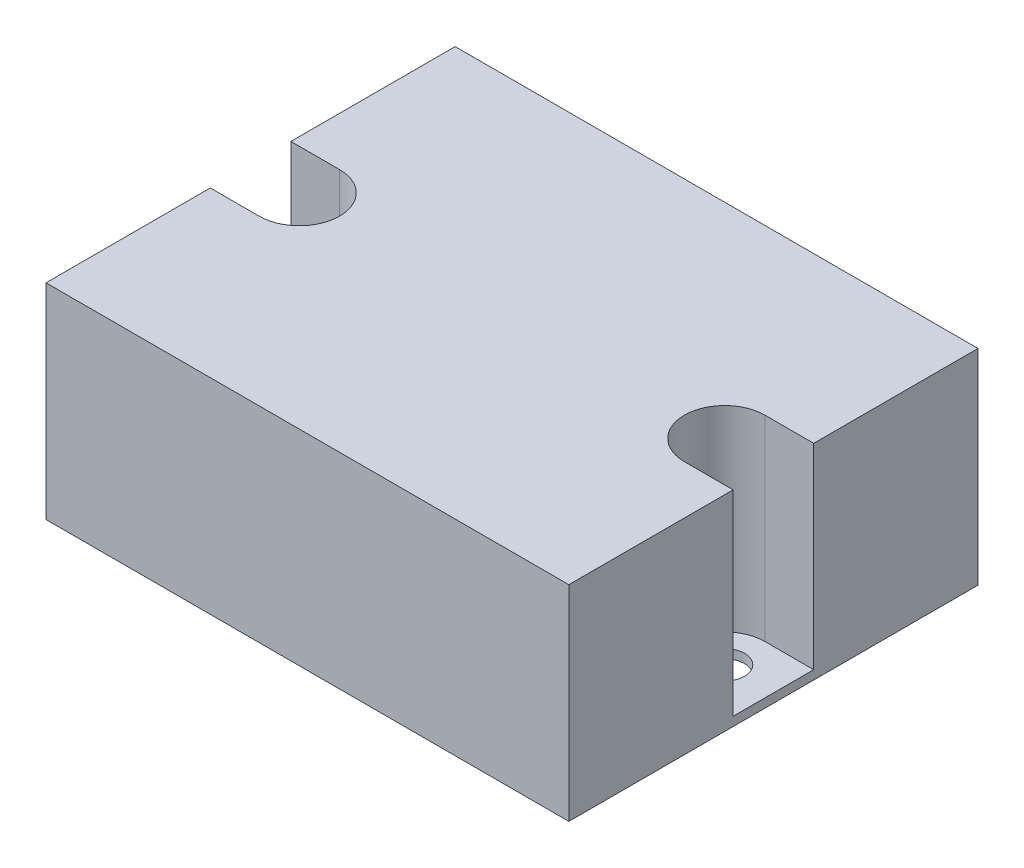
ISO-10303-21;
HEADER;
FILE_DESCRIPTION(('STEP AP214'),'2;1');
FILE_NAME('part.step','',(''),(''),'','','');
FILE_SCHEMA(('AUTOMOTIVE_DESIGN { 1 0 10303 214 1 1 1 1 }'));
ENDSEC;
DATA;
#1=APPLICATION_CONTEXT('core data for automotive mechanical design processes');
#2=APPLICATION_PROTOCOL_DEFINITION('international standard','automotive_design',2000,#1);
#3=PRODUCT_CONTEXT('',#1,'mechanical');
#4=PRODUCT('Part','Part','',(#3));
#5=PRODUCT_RELATED_PRODUCT_CATEGORY('part','',(#4));
#6=PRODUCT_DEFINITION_FORMATION('','',#4);
#7=PRODUCT_DEFINITION_CONTEXT('part definition',#1,'design');
#8=PRODUCT_DEFINITION('design','',#6,#7);
#9=PRODUCT_DEFINITION_SHAPE('','',#8);
#10=(LENGTH_UNIT() NAMED_UNIT(*) SI_UNIT(.MILLI.,.METRE.));
#11=(NAMED_UNIT(*) PLANE_ANGLE_UNIT() SI_UNIT($,.RADIAN.));
#12=(NAMED_UNIT(*) SI_UNIT($,.STERADIAN.) SOLID_ANGLE_UNIT());
#13=UNCERTAINTY_MEASURE_WITH_UNIT(LENGTH_MEASURE(1.E-05),#10,'distance_accuracy_value','');
#14=(GEOMETRIC_REPRESENTATION_CONTEXT(3) GLOBAL_UNCERTAINTY_ASSIGNED_CONTEXT((#13)) GLOBAL_UNIT_ASSIGNED_CONTEXT((#10,
#11,#12)) REPRESENTATION_CONTEXT('',''));
#15=CARTESIAN_POINT('',(0.,0.,0.));
#16=DIRECTION('',(0.,0.,1.));
#17=DIRECTION('',(1.,0.,0.));
#18=AXIS2_PLACEMENT_3D('',#15,#16,#17);
#19=CARTESIAN_POINT('',(5.45,1.,-22.85));
#20=DIRECTION('',(0.,1.,0.));
#21=DIRECTION('',(0.,0.,1.));
#22=AXIS2_PLACEMENT_3D('',#19,#20,#21);
#23=PLANE('',#22);
#24=DIRECTION('',(1.,0.,0.));
#25=VECTOR('',#24,1.);
#26=CARTESIAN_POINT('',(52.95,1.,-27.35));
#27=LINE('',#26,#25);
#28=CARTESIAN_POINT('',(52.95,1.,-27.35));
#29=VERTEX_POINT('',#28);
#30=CARTESIAN_POINT('',(58.4,1.,-27.35));
#31=VERTEX_POINT('',#30);
#32=EDGE_CURVE('E50',#29,#31,#27,.T.);
#33=ORIENTED_EDGE('',*,*,#32,.F.);
#34=CARTESIAN_POINT('',(52.95,1.,-22.85));
#35=DIRECTION('',(0.,-1.,0.));
#36=DIRECTION('',(0.,0.,1.));
#37=AXIS2_PLACEMENT_3D('',#34,#35,#36);
#38=CIRCLE('',#37,4.5);
#39=CARTESIAN_POINT('',(52.95,1.,-18.35));
#40=VERTEX_POINT('',#39);
#41=EDGE_CURVE('E54',#40,#29,#38,.T.);
#42=ORIENTED_EDGE('',*,*,#41,.F.);
#43=DIRECTION('',(-1.,0.,0.));
#44=VECTOR('',#43,1.);
#45=CARTESIAN_POINT('',(52.95,1.,-18.35));
#46=LINE('',#45,#44);
#47=CARTESIAN_POINT('',(58.4,1.,-18.35));
#48=VERTEX_POINT('',#47);
#49=EDGE_CURVE('E300',#48,#40,#46,.T.);
#50=ORIENTED_EDGE('',*,*,#49,.F.);
#51=DIRECTION('',(0.,0.,-1.));
#52=VECTOR('',#51,1.);
#53=CARTESIAN_POINT('',(58.4,1.,0.));
#54=LINE('',#53,#52);
#55=EDGE_CURVE('E213',#48,#31,#54,.T.);
#56=ORIENTED_EDGE('',*,*,#55,.T.);
#57=EDGE_LOOP('',(#33,#42,#50,#56));
#58=FACE_BOUND('',#57,.T.);
#59=CARTESIAN_POINT('',(52.95,1.,-22.85));
#60=DIRECTION('',(0.,1.,0.));
#61=DIRECTION('',(0.,0.,1.));
#62=AXIS2_PLACEMENT_3D('',#59,#60,#61);
#63=CIRCLE('',#62,2.225);
#64=CARTESIAN_POINT('',(52.95,1.,-20.625));
#65=VERTEX_POINT('',#64);
#66=EDGE_CURVE('E175',#65,#65,#63,.T.);
#67=ORIENTED_EDGE('',*,*,#66,.F.);
#68=EDGE_LOOP('',(#67));
#69=FACE_BOUND('',#68,.T.);
#70=ADVANCED_FACE('F33',(#58,#69),#23,.T.);
#71=DIRECTION('',(-1.,0.,0.));
#72=VECTOR('',#71,1.);
#73=CARTESIAN_POINT('',(5.45,1.,-18.35));
#74=LINE('',#73,#72);
#75=CARTESIAN_POINT('',(5.45,1.,-18.35));
#76=VERTEX_POINT('',#75);
#77=CARTESIAN_POINT('',(0.,1.,-18.35));
#78=VERTEX_POINT('',#77);
#79=EDGE_CURVE('E296',#76,#78,#74,.T.);
#80=ORIENTED_EDGE('',*,*,#79,.F.);
#81=CARTESIAN_POINT('',(5.45,1.,-22.85));
#82=DIRECTION('',(0.,-1.,0.));
#83=DIRECTION('',(0.,0.,1.));
#84=AXIS2_PLACEMENT_3D('',#81,#82,#83);
#85=CIRCLE('',#84,4.5);
#86=CARTESIAN_POINT('',(5.45,1.,-27.35));
#87=VERTEX_POINT('',#86);
#88=EDGE_CURVE('E295',#87,#76,#85,.T.);
#89=ORIENTED_EDGE('',*,*,#88,.F.);
#90=DIRECTION('',(1.,0.,0.));
#91=VECTOR('',#90,1.);
#92=CARTESIAN_POINT('',(5.45,1.,-27.35));
#93=LINE('',#92,#91);
#94=CARTESIAN_POINT('',(0.,1.,-27.35));
#95=VERTEX_POINT('',#94);
#96=EDGE_CURVE('E218',#95,#87,#93,.T.);
#97=ORIENTED_EDGE('',*,*,#96,.F.);
#98=DIRECTION('',(0.,0.,1.));
#99=VECTOR('',#98,1.);
#100=CARTESIAN_POINT('',(0.,1.,-25.1));
#101=LINE('',#100,#99);
#102=CARTESIAN_POINT('',(0.,1.,-25.1));
#103=VERTEX_POINT('',#102);
#104=EDGE_CURVE('E171',#95,#103,#101,.T.);
#105=ORIENTED_EDGE('',*,*,#104,.T.);
#106=DIRECTION('',(1.,0.,0.));
#107=VECTOR('',#106,1.);
#108=CARTESIAN_POINT('',(5.45,1.,-25.1));
#109=LINE('',#108,#107);
#110=CARTESIAN_POINT('',(5.45,1.,-25.1));
#111=VERTEX_POINT('',#110);
#112=EDGE_CURVE('E217',#103,#111,#109,.T.);
#113=ORIENTED_EDGE('',*,*,#112,.T.);
#114=CARTESIAN_POINT('',(5.45,1.,-22.85));
#115=DIRECTION('',(0.,-1.,0.));
#116=DIRECTION('',(0.,0.,1.));
#117=AXIS2_PLACEMENT_3D('',#114,#115,#116);
#118=CIRCLE('',#117,2.25);
#119=CARTESIAN_POINT('',(5.45,1.,-20.6));
#120=VERTEX_POINT('',#119);
#121=EDGE_CURVE('E222',#111,#120,#118,.T.);
#122=ORIENTED_EDGE('',*,*,#121,.T.);
#123=DIRECTION('',(-1.,0.,0.));
#124=VECTOR('',#123,1.);
#125=CARTESIAN_POINT('',(5.45,1.,-20.6));
#126=LINE('',#125,#124);
#127=CARTESIAN_POINT('',(0.,1.,-20.6));
#128=VERTEX_POINT('',#127);
#129=EDGE_CURVE('E224',#120,#128,#126,.T.);
#130=ORIENTED_EDGE('',*,*,#129,.T.);
#131=DIRECTION('',(0.,0.,1.));
#132=VECTOR('',#131,1.);
#133=CARTESIAN_POINT('',(0.,1.,0.));
#134=LINE('',#133,#132);
#135=EDGE_CURVE('E211',#128,#78,#134,.T.);
#136=ORIENTED_EDGE('',*,*,#135,.T.);
#137=EDGE_LOOP('',(#80,#89,#97,#105,#113,#122,#130,#136));
#138=FACE_BOUND('',#137,.T.);
#139=ADVANCED_FACE('F292',(#138),#23,.T.);
#140=CARTESIAN_POINT('',(5.45,0.,-22.85));
#141=DIRECTION('',(0.,1.,0.));
#142=DIRECTION('',(0.,0.,1.));
#143=AXIS2_PLACEMENT_3D('',#140,#141,#142);
#144=PLANE('',#143);
#145=DIRECTION('',(0.,0.,1.));
#146=VECTOR('',#145,1.);
#147=CARTESIAN_POINT('',(0.,0.,0.));
#148=LINE('',#147,#146);
#149=CARTESIAN_POINT('',(0.,0.,-20.6));
#150=VERTEX_POINT('',#149);
#151=CARTESIAN_POINT('',(0.,0.,0.));
#152=VERTEX_POINT('',#151);
#153=EDGE_CURVE('E204',#150,#152,#148,.T.);
#154=ORIENTED_EDGE('',*,*,#153,.F.);
#155=DIRECTION('',(-1.,0.,0.));
#156=VECTOR('',#155,1.);
#157=CARTESIAN_POINT('',(5.45,0.,-20.6));
#158=LINE('',#157,#156);
#159=CARTESIAN_POINT('',(5.45,0.,-20.6));
#160=VERTEX_POINT('',#159);
#161=EDGE_CURVE('E214',#160,#150,#158,.T.);
#162=ORIENTED_EDGE('',*,*,#161,.F.);
#163=CARTESIAN_POINT('',(5.45,0.,-22.85));
#164=DIRECTION('',(0.,-1.,0.));
#165=DIRECTION('',(0.,0.,1.));
#166=AXIS2_PLACEMENT_3D('',#163,#164,#165);
#167=CIRCLE('',#166,2.25);
#168=CARTESIAN_POINT('',(5.45,0.,-25.1));
#169=VERTEX_POINT('',#168);
#170=EDGE_CURVE('E239',#169,#160,#167,.T.);
#171=ORIENTED_EDGE('',*,*,#170,.F.);
#172=DIRECTION('',(1.,0.,0.));
#173=VECTOR('',#172,1.);
#174=CARTESIAN_POINT('',(5.45,0.,-25.1));
#175=LINE('',#174,#173);
#176=CARTESIAN_POINT('',(0.,0.,-25.1));
#177=VERTEX_POINT('',#176);
#178=EDGE_CURVE('E237',#177,#169,#175,.T.);
#179=ORIENTED_EDGE('',*,*,#178,.F.);
#180=DIRECTION('',(0.,0.,1.));
#181=VECTOR('',#180,1.);
#182=CARTESIAN_POINT('',(0.,0.,-25.1));
#183=LINE('',#182,#181);
#184=CARTESIAN_POINT('',(0.,0.,-45.7));
#185=VERTEX_POINT('',#184);
#186=EDGE_CURVE('E235',#185,#177,#183,.T.);
#187=ORIENTED_EDGE('',*,*,#186,.F.);
#188=DIRECTION('',(-1.,0.,0.));
#189=VECTOR('',#188,1.);
#190=CARTESIAN_POINT('',(0.,0.,-45.7));
#191=LINE('',#190,#189);
#192=CARTESIAN_POINT('',(58.4,0.,-45.7));
#193=VERTEX_POINT('',#192);
#194=EDGE_CURVE('E233',#193,#185,#191,.T.);
#195=ORIENTED_EDGE('',*,*,#194,.F.);
#196=DIRECTION('',(0.,0.,-1.));
#197=VECTOR('',#196,1.);
#198=CARTESIAN_POINT('',(58.4,0.,0.));
#199=LINE('',#198,#197);
#200=CARTESIAN_POINT('',(58.4,0.,0.));
#201=VERTEX_POINT('',#200);
#202=EDGE_CURVE('E231',#201,#193,#199,.T.);
#203=ORIENTED_EDGE('',*,*,#202,.F.);
#204=DIRECTION('',(1.,0.,0.));
#205=VECTOR('',#204,1.);
#206=CARTESIAN_POINT('',(0.,0.,0.));
#207=LINE('',#206,#205);
#208=EDGE_CURVE('E229',#152,#201,#207,.T.);
#209=ORIENTED_EDGE('',*,*,#208,.F.);
#210=EDGE_LOOP('',(#154,#162,#171,#179,#187,#195,#203,#209));
#211=FACE_BOUND('',#210,.T.);
#212=CARTESIAN_POINT('',(52.95,0.,-22.85));
#213=DIRECTION('',(0.,1.,0.));
#214=DIRECTION('',(0.,0.,1.));
#215=AXIS2_PLACEMENT_3D('',#212,#213,#214);
#216=CIRCLE('',#215,2.225);
#217=CARTESIAN_POINT('',(52.95,0.,-20.625));
#218=VERTEX_POINT('',#217);
#219=EDGE_CURVE('E172',#218,#218,#216,.T.);
#220=ORIENTED_EDGE('',*,*,#219,.T.);
#221=EDGE_LOOP('',(#220));
#222=FACE_BOUND('',#221,.T.);
#223=ADVANCED_FACE('F270',(#211,#222),#144,.F.);
#224=CARTESIAN_POINT('',(0.,1.,0.));
#225=DIRECTION('',(1.,0.,0.));
#226=DIRECTION('',(0.,0.,-1.));
#227=AXIS2_PLACEMENT_3D('',#224,#225,#226);
#228=PLANE('',#227);
#229=ORIENTED_EDGE('',*,*,#153,.T.);
#230=DIRECTION('',(0.,-1.,0.));
#231=VECTOR('',#230,1.);
#232=CARTESIAN_POINT('',(0.,1.,0.));
#233=LINE('',#232,#231);
#234=CARTESIAN_POINT('',(0.,22.9,0.));
#235=VERTEX_POINT('',#234);
#236=EDGE_CURVE('E11',#235,#152,#233,.T.);
#237=ORIENTED_EDGE('',*,*,#236,.F.);
#238=DIRECTION('',(0.,0.,1.));
#239=VECTOR('',#238,1.);
#240=CARTESIAN_POINT('',(0.,22.9,-18.35));
#241=LINE('',#240,#239);
#242=CARTESIAN_POINT('',(0.,22.9,-18.35));
#243=VERTEX_POINT('',#242);
#244=EDGE_CURVE('E341',#243,#235,#241,.T.);
#245=ORIENTED_EDGE('',*,*,#244,.F.);
#246=DIRECTION('',(0.,-1.,0.));
#247=VECTOR('',#246,1.);
#248=CARTESIAN_POINT('',(0.,22.9,-18.35));
#249=LINE('',#248,#247);
#250=EDGE_CURVE('E201',#243,#78,#249,.T.);
#251=ORIENTED_EDGE('',*,*,#250,.T.);
#252=ORIENTED_EDGE('',*,*,#135,.F.);
#253=DIRECTION('',(0.,-1.,0.));
#254=VECTOR('',#253,1.);
#255=CARTESIAN_POINT('',(0.,1.,-20.6));
#256=LINE('',#255,#254);
#257=EDGE_CURVE('E226',#128,#150,#256,.T.);
#258=ORIENTED_EDGE('',*,*,#257,.T.);
#259=EDGE_LOOP('',(#229,#237,#245,#251,#252,#258));
#260=FACE_BOUND('',#259,.T.);
#261=ADVANCED_FACE('F35',(#260),#228,.F.);
#262=CARTESIAN_POINT('',(0.,1.,0.));
#263=DIRECTION('',(0.,0.,-1.));
#264=DIRECTION('',(-1.,0.,0.));
#265=AXIS2_PLACEMENT_3D('',#262,#263,#264);
#266=PLANE('',#265);
#267=ORIENTED_EDGE('',*,*,#208,.T.);
#268=DIRECTION('',(0.,-1.,0.));
#269=VECTOR('',#268,1.);
#270=CARTESIAN_POINT('',(58.4,1.,0.));
#271=LINE('',#270,#269);
#272=CARTESIAN_POINT('',(58.4,22.9,0.));
#273=VERTEX_POINT('',#272);
#274=EDGE_CURVE('E42',#273,#201,#271,.T.);
#275=ORIENTED_EDGE('',*,*,#274,.F.);
#276=DIRECTION('',(1.,0.,0.));
#277=VECTOR('',#276,1.);
#278=CARTESIAN_POINT('',(0.,22.9,0.));
#279=LINE('',#278,#277);
#280=EDGE_CURVE('E339',#235,#273,#279,.T.);
#281=ORIENTED_EDGE('',*,*,#280,.F.);
#282=ORIENTED_EDGE('',*,*,#236,.T.);
#283=EDGE_LOOP('',(#267,#275,#281,#282));
#284=FACE_BOUND('',#283,.T.);
#285=ADVANCED_FACE('F350',(#284),#266,.F.);
#286=CARTESIAN_POINT('',(58.4,1.,0.));
#287=DIRECTION('',(-1.,0.,0.));
#288=DIRECTION('',(0.,0.,1.));
#289=AXIS2_PLACEMENT_3D('',#286,#287,#288);
#290=PLANE('',#289);
#291=ORIENTED_EDGE('',*,*,#202,.T.);
#292=DIRECTION('',(0.,-1.,0.));
#293=VECTOR('',#292,1.);
#294=CARTESIAN_POINT('',(58.4,1.,-45.7));
#295=LINE('',#294,#293);
#296=CARTESIAN_POINT('',(58.4,22.9,-45.7));
#297=VERTEX_POINT('',#296);
#298=EDGE_CURVE('E255',#297,#193,#295,.T.);
#299=ORIENTED_EDGE('',*,*,#298,.F.);
#300=DIRECTION('',(0.,0.,-1.));
#301=VECTOR('',#300,1.);
#302=CARTESIAN_POINT('',(58.4,22.9,-45.7));
#303=LINE('',#302,#301);
#304=CARTESIAN_POINT('',(58.4,22.9,-27.35));
#305=VERTEX_POINT('',#304);
#306=EDGE_CURVE('E331',#305,#297,#303,.T.);
#307=ORIENTED_EDGE('',*,*,#306,.F.);
#308=DIRECTION('',(0.,-1.,0.));
#309=VECTOR('',#308,1.);
#310=CARTESIAN_POINT('',(58.4,22.9,-27.35));
#311=LINE('',#310,#309);
#312=EDGE_CURVE('E187',#305,#31,#311,.T.);
#313=ORIENTED_EDGE('',*,*,#312,.T.);
#314=ORIENTED_EDGE('',*,*,#55,.F.);
#315=DIRECTION('',(0.,-1.,0.));
#316=VECTOR('',#315,1.);
#317=CARTESIAN_POINT('',(58.4,22.9,-18.35));
#318=LINE('',#317,#316);
#319=CARTESIAN_POINT('',(58.4,22.9,-18.35));
#320=VERTEX_POINT('',#319);
#321=EDGE_CURVE('E199',#320,#48,#318,.T.);
#322=ORIENTED_EDGE('',*,*,#321,.F.);
#323=DIRECTION('',(0.,0.,-1.));
#324=VECTOR('',#323,1.);
#325=CARTESIAN_POINT('',(58.4,22.9,-18.35));
#326=LINE('',#325,#324);
#327=EDGE_CURVE('E263',#273,#320,#326,.T.);
#328=ORIENTED_EDGE('',*,*,#327,.F.);
#329=ORIENTED_EDGE('',*,*,#274,.T.);
#330=EDGE_LOOP('',(#291,#299,#307,#313,#314,#322,#328,#329));
#331=FACE_BOUND('',#330,.T.);
#332=ADVANCED_FACE('F261',(#331),#290,.F.);
#333=CARTESIAN_POINT('',(0.,1.,-45.7));
#334=DIRECTION('',(0.,0.,1.));
#335=DIRECTION('',(1.,0.,0.));
#336=AXIS2_PLACEMENT_3D('',#333,#334,#335);
#337=PLANE('',#336);
#338=ORIENTED_EDGE('',*,*,#194,.T.);
#339=DIRECTION('',(0.,-1.,0.));
#340=VECTOR('',#339,1.);
#341=CARTESIAN_POINT('',(0.,1.,-45.7));
#342=LINE('',#341,#340);
#343=CARTESIAN_POINT('',(0.,22.9,-45.7));
#344=VERTEX_POINT('',#343);
#345=EDGE_CURVE('E253',#344,#185,#342,.T.);
#346=ORIENTED_EDGE('',*,*,#345,.F.);
#347=DIRECTION('',(-1.,0.,0.));
#348=VECTOR('',#347,1.);
#349=CARTESIAN_POINT('',(0.,22.9,-45.7));
#350=LINE('',#349,#348);
#351=EDGE_CURVE('E164',#297,#344,#350,.T.);
#352=ORIENTED_EDGE('',*,*,#351,.F.);
#353=ORIENTED_EDGE('',*,*,#298,.T.);
#354=EDGE_LOOP('',(#338,#346,#352,#353));
#355=FACE_BOUND('',#354,.T.);
#356=ADVANCED_FACE('F275',(#355),#337,.F.);
#357=CARTESIAN_POINT('',(0.,1.,-25.1));
#358=DIRECTION('',(1.,0.,0.));
#359=DIRECTION('',(0.,0.,-1.));
#360=AXIS2_PLACEMENT_3D('',#357,#358,#359);
#361=PLANE('',#360);
#362=ORIENTED_EDGE('',*,*,#186,.T.);
#363=DIRECTION('',(0.,-1.,0.));
#364=VECTOR('',#363,1.);
#365=CARTESIAN_POINT('',(0.,1.,-25.1));
#366=LINE('',#365,#364);
#367=EDGE_CURVE('E250',#103,#177,#366,.T.);
#368=ORIENTED_EDGE('',*,*,#367,.F.);
#369=ORIENTED_EDGE('',*,*,#104,.F.);
#370=DIRECTION('',(0.,-1.,0.));
#371=VECTOR('',#370,1.);
#372=CARTESIAN_POINT('',(0.,22.9,-27.35));
#373=LINE('',#372,#371);
#374=CARTESIAN_POINT('',(0.,22.9,-27.35));
#375=VERTEX_POINT('',#374);
#376=EDGE_CURVE('E151',#375,#95,#373,.T.);
#377=ORIENTED_EDGE('',*,*,#376,.F.);
#378=DIRECTION('',(0.,0.,1.));
#379=VECTOR('',#378,1.);
#380=CARTESIAN_POINT('',(0.,22.9,-45.7));
#381=LINE('',#380,#379);
#382=EDGE_CURVE('E157',#344,#375,#381,.T.);
#383=ORIENTED_EDGE('',*,*,#382,.F.);
#384=ORIENTED_EDGE('',*,*,#345,.T.);
#385=EDGE_LOOP('',(#362,#368,#369,#377,#383,#384));
#386=FACE_BOUND('',#385,.T.);
#387=ADVANCED_FACE('F169',(#386),#361,.F.);
#388=CARTESIAN_POINT('',(5.45,1.,-25.1));
#389=DIRECTION('',(0.,0.,-1.));
#390=DIRECTION('',(-1.,0.,0.));
#391=AXIS2_PLACEMENT_3D('',#388,#389,#390);
#392=PLANE('',#391);
#393=ORIENTED_EDGE('',*,*,#178,.T.);
#394=DIRECTION('',(0.,-1.,0.));
#395=VECTOR('',#394,1.);
#396=CARTESIAN_POINT('',(5.45,1.,-25.1));
#397=LINE('',#396,#395);
#398=EDGE_CURVE('E247',#111,#169,#397,.T.);
#399=ORIENTED_EDGE('',*,*,#398,.F.);
#400=ORIENTED_EDGE('',*,*,#112,.F.);
#401=ORIENTED_EDGE('',*,*,#367,.T.);
#402=EDGE_LOOP('',(#393,#399,#400,#401));
#403=FACE_BOUND('',#402,.T.);
#404=ADVANCED_FACE('F278',(#403),#392,.F.);
#405=CARTESIAN_POINT('',(5.45,1.,-22.85));
#406=DIRECTION('',(0.,-1.,0.));
#407=DIRECTION('',(0.,0.,-1.));
#408=AXIS2_PLACEMENT_3D('',#405,#406,#407);
#409=CYLINDRICAL_SURFACE('',#408,2.25);
#410=ORIENTED_EDGE('',*,*,#170,.T.);
#411=DIRECTION('',(0.,-1.,0.));
#412=VECTOR('',#411,1.);
#413=CARTESIAN_POINT('',(5.45,1.,-20.6));
#414=LINE('',#413,#412);
#415=EDGE_CURVE('E244',#120,#160,#414,.T.);
#416=ORIENTED_EDGE('',*,*,#415,.F.);
#417=ORIENTED_EDGE('',*,*,#121,.F.);
#418=ORIENTED_EDGE('',*,*,#398,.T.);
#419=EDGE_LOOP('',(#410,#416,#417,#418));
#420=FACE_BOUND('',#419,.T.);
#421=ADVANCED_FACE('F284',(#420),#409,.F.);
#422=CARTESIAN_POINT('',(5.45,1.,-20.6));
#423=DIRECTION('',(0.,0.,1.));
#424=DIRECTION('',(1.,0.,0.));
#425=AXIS2_PLACEMENT_3D('',#422,#423,#424);
#426=PLANE('',#425);
#427=ORIENTED_EDGE('',*,*,#161,.T.);
#428=ORIENTED_EDGE('',*,*,#257,.F.);
#429=ORIENTED_EDGE('',*,*,#129,.F.);
#430=ORIENTED_EDGE('',*,*,#415,.T.);
#431=EDGE_LOOP('',(#427,#428,#429,#430));
#432=FACE_BOUND('',#431,.T.);
#433=ADVANCED_FACE('F288',(#432),#426,.F.);
#434=CARTESIAN_POINT('',(52.95,1.,-22.85));
#435=DIRECTION('',(0.,-1.,0.));
#436=DIRECTION('',(0.,0.,-1.));
#437=AXIS2_PLACEMENT_3D('',#434,#435,#436);
#438=CYLINDRICAL_SURFACE('',#437,2.225);
#439=ORIENTED_EDGE('',*,*,#66,.T.);
#440=EDGE_LOOP('',(#439));
#441=FACE_BOUND('',#440,.T.);
#442=ORIENTED_EDGE('',*,*,#219,.F.);
#443=EDGE_LOOP('',(#442));
#444=FACE_BOUND('',#443,.T.);
#445=ADVANCED_FACE('F365',(#441,#444),#438,.F.);
#446=CARTESIAN_POINT('',(5.45,22.9,-27.35));
#447=DIRECTION('',(0.,0.,-1.));
#448=DIRECTION('',(-1.,0.,0.));
#449=AXIS2_PLACEMENT_3D('',#446,#447,#448);
#450=PLANE('',#449);
#451=ORIENTED_EDGE('',*,*,#96,.T.);
#452=DIRECTION('',(0.,-1.,0.));
#453=VECTOR('',#452,1.);
#454=CARTESIAN_POINT('',(5.45,22.9,-27.35));
#455=LINE('',#454,#453);
#456=CARTESIAN_POINT('',(5.45,22.9,-27.35));
#457=VERTEX_POINT('',#456);
#458=EDGE_CURVE('E153',#457,#87,#455,.T.);
#459=ORIENTED_EDGE('',*,*,#458,.F.);
#460=DIRECTION('',(1.,0.,0.));
#461=VECTOR('',#460,1.);
#462=CARTESIAN_POINT('',(5.45,22.9,-27.35));
#463=LINE('',#462,#461);
#464=EDGE_CURVE('E146',#375,#457,#463,.T.);
#465=ORIENTED_EDGE('',*,*,#464,.F.);
#466=ORIENTED_EDGE('',*,*,#376,.T.);
#467=EDGE_LOOP('',(#451,#459,#465,#466));
#468=FACE_BOUND('',#467,.T.);
#469=ADVANCED_FACE('F149',(#468),#450,.F.);
#470=CARTESIAN_POINT('',(5.45,22.9,-22.85));
#471=DIRECTION('',(0.,-1.,0.));
#472=DIRECTION('',(0.,0.,-1.));
#473=AXIS2_PLACEMENT_3D('',#470,#471,#472);
#474=CYLINDRICAL_SURFACE('',#473,4.5);
#475=ORIENTED_EDGE('',*,*,#88,.T.);
#476=DIRECTION('',(0.,-1.,0.));
#477=VECTOR('',#476,1.);
#478=CARTESIAN_POINT('',(5.45,22.9,-18.35));
#479=LINE('',#478,#477);
#480=CARTESIAN_POINT('',(5.45,22.9,-18.35));
#481=VERTEX_POINT('',#480);
#482=EDGE_CURVE('E177',#481,#76,#479,.T.);
#483=ORIENTED_EDGE('',*,*,#482,.F.);
#484=CARTESIAN_POINT('',(5.45,22.9,-22.85));
#485=DIRECTION('',(0.,-1.,0.));
#486=DIRECTION('',(0.,0.,1.));
#487=AXIS2_PLACEMENT_3D('',#484,#485,#486);
#488=CIRCLE('',#487,4.5);
#489=EDGE_CURVE('E156',#457,#481,#488,.T.);
#490=ORIENTED_EDGE('',*,*,#489,.F.);
#491=ORIENTED_EDGE('',*,*,#458,.T.);
#492=EDGE_LOOP('',(#475,#483,#490,#491));
#493=FACE_BOUND('',#492,.T.);
#494=ADVANCED_FACE('F347',(#493),#474,.F.);
#495=CARTESIAN_POINT('',(5.45,22.9,-18.35));
#496=DIRECTION('',(0.,0.,1.));
#497=DIRECTION('',(1.,0.,0.));
#498=AXIS2_PLACEMENT_3D('',#495,#496,#497);
#499=PLANE('',#498);
#500=ORIENTED_EDGE('',*,*,#79,.T.);
#501=ORIENTED_EDGE('',*,*,#250,.F.);
#502=DIRECTION('',(-1.,0.,0.));
#503=VECTOR('',#502,1.);
#504=CARTESIAN_POINT('',(5.45,22.9,-18.35));
#505=LINE('',#504,#503);
#506=EDGE_CURVE('E344',#481,#243,#505,.T.);
#507=ORIENTED_EDGE('',*,*,#506,.F.);
#508=ORIENTED_EDGE('',*,*,#482,.T.);
#509=EDGE_LOOP('',(#500,#501,#507,#508));
#510=FACE_BOUND('',#509,.T.);
#511=ADVANCED_FACE('F349',(#510),#499,.F.);
#512=CARTESIAN_POINT('',(52.95,22.9,-18.35));
#513=DIRECTION('',(0.,0.,1.));
#514=DIRECTION('',(1.,0.,0.));
#515=AXIS2_PLACEMENT_3D('',#512,#513,#514);
#516=PLANE('',#515);
#517=ORIENTED_EDGE('',*,*,#49,.T.);
#518=DIRECTION('',(0.,-1.,0.));
#519=VECTOR('',#518,1.);
#520=CARTESIAN_POINT('',(52.95,22.9,-18.35));
#521=LINE('',#520,#519);
#522=CARTESIAN_POINT('',(52.95,22.9,-18.35));
#523=VERTEX_POINT('',#522);
#524=EDGE_CURVE('E196',#523,#40,#521,.T.);
#525=ORIENTED_EDGE('',*,*,#524,.F.);
#526=DIRECTION('',(-1.,0.,0.));
#527=VECTOR('',#526,1.);
#528=CARTESIAN_POINT('',(52.95,22.9,-18.35));
#529=LINE('',#528,#527);
#530=EDGE_CURVE('E334',#320,#523,#529,.T.);
#531=ORIENTED_EDGE('',*,*,#530,.F.);
#532=ORIENTED_EDGE('',*,*,#321,.T.);
#533=EDGE_LOOP('',(#517,#525,#531,#532));
#534=FACE_BOUND('',#533,.T.);
#535=ADVANCED_FACE('F422',(#534),#516,.F.);
#536=CARTESIAN_POINT('',(52.95,22.9,-22.85));
#537=DIRECTION('',(0.,-1.,0.));
#538=DIRECTION('',(0.,0.,-1.));
#539=AXIS2_PLACEMENT_3D('',#536,#537,#538);
#540=CYLINDRICAL_SURFACE('',#539,4.5);
#541=ORIENTED_EDGE('',*,*,#41,.T.);
#542=DIRECTION('',(0.,-1.,0.));
#543=VECTOR('',#542,1.);
#544=CARTESIAN_POINT('',(52.95,22.9,-27.35));
#545=LINE('',#544,#543);
#546=CARTESIAN_POINT('',(52.95,22.9,-27.35));
#547=VERTEX_POINT('',#546);
#548=EDGE_CURVE('E193',#547,#29,#545,.T.);
#549=ORIENTED_EDGE('',*,*,#548,.F.);
#550=CARTESIAN_POINT('',(52.95,22.9,-22.85));
#551=DIRECTION('',(0.,-1.,0.));
#552=DIRECTION('',(0.,0.,1.));
#553=AXIS2_PLACEMENT_3D('',#550,#551,#552);
#554=CIRCLE('',#553,4.5);
#555=EDGE_CURVE('E332',#523,#547,#554,.T.);
#556=ORIENTED_EDGE('',*,*,#555,.F.);
#557=ORIENTED_EDGE('',*,*,#524,.T.);
#558=EDGE_LOOP('',(#541,#549,#556,#557));
#559=FACE_BOUND('',#558,.T.);
#560=ADVANCED_FACE('F322',(#559),#540,.F.);
#561=CARTESIAN_POINT('',(52.95,22.9,-27.35));
#562=DIRECTION('',(0.,0.,-1.));
#563=DIRECTION('',(-1.,0.,0.));
#564=AXIS2_PLACEMENT_3D('',#561,#562,#563);
#565=PLANE('',#564);
#566=ORIENTED_EDGE('',*,*,#32,.T.);
#567=ORIENTED_EDGE('',*,*,#312,.F.);
#568=DIRECTION('',(1.,0.,0.));
#569=VECTOR('',#568,1.);
#570=CARTESIAN_POINT('',(52.95,22.9,-27.35));
#571=LINE('',#570,#569);
#572=EDGE_CURVE('E329',#547,#305,#571,.T.);
#573=ORIENTED_EDGE('',*,*,#572,.F.);
#574=ORIENTED_EDGE('',*,*,#548,.T.);
#575=EDGE_LOOP('',(#566,#567,#573,#574));
#576=FACE_BOUND('',#575,.T.);
#577=ADVANCED_FACE('F326',(#576),#565,.F.);
#578=CARTESIAN_POINT('',(5.45,22.9,-22.85));
#579=DIRECTION('',(0.,1.,0.));
#580=DIRECTION('',(0.,0.,1.));
#581=AXIS2_PLACEMENT_3D('',#578,#579,#580);
#582=PLANE('',#581);
#583=ORIENTED_EDGE('',*,*,#382,.T.);
#584=ORIENTED_EDGE('',*,*,#464,.T.);
#585=ORIENTED_EDGE('',*,*,#489,.T.);
#586=ORIENTED_EDGE('',*,*,#506,.T.);
#587=ORIENTED_EDGE('',*,*,#244,.T.);
#588=ORIENTED_EDGE('',*,*,#280,.T.);
#589=ORIENTED_EDGE('',*,*,#327,.T.);
#590=ORIENTED_EDGE('',*,*,#530,.T.);
#591=ORIENTED_EDGE('',*,*,#555,.T.);
#592=ORIENTED_EDGE('',*,*,#572,.T.);
#593=ORIENTED_EDGE('',*,*,#306,.T.);
#594=ORIENTED_EDGE('',*,*,#351,.T.);
#595=EDGE_LOOP('',(#583,#584,#585,#586,#587,#588,#589,#590,#591,#592,#593,#594));
#596=FACE_BOUND('',#595,.T.);
#597=ADVANCED_FACE('F161',(#596),#582,.T.);
#598=CLOSED_SHELL('',(#70,#139,#223,#261,#285,#332,#356,#387,#404,#421,#433,#445,#469,#494,#511,
#535,#560,#577,#597));
#599=MANIFOLD_SOLID_BREP('B2',#598);
#600=ADVANCED_BREP_SHAPE_REPRESENTATION('',(#18,#599),#14);
#601=SHAPE_DEFINITION_REPRESENTATION(#9,#600);
ENDSEC;
END-ISO-10303-21;
